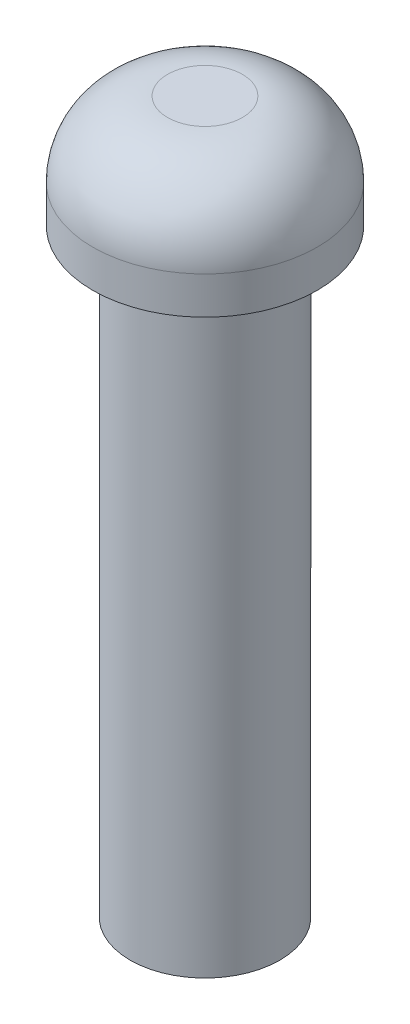
ISO-10303-21;
HEADER;
FILE_DESCRIPTION(('STEP AP214'),'2;1');
FILE_NAME('part.step','',(''),(''),'','','');
FILE_SCHEMA(('AUTOMOTIVE_DESIGN { 1 0 10303 214 1 1 1 1 }'));
ENDSEC;
DATA;
#1=APPLICATION_CONTEXT('core data for automotive mechanical design processes');
#2=APPLICATION_PROTOCOL_DEFINITION('international standard','automotive_design',2000,#1);
#3=PRODUCT_CONTEXT('',#1,'mechanical');
#4=PRODUCT('Part','Part','',(#3));
#5=PRODUCT_RELATED_PRODUCT_CATEGORY('part','',(#4));
#6=PRODUCT_DEFINITION_FORMATION('','',#4);
#7=PRODUCT_DEFINITION_CONTEXT('part definition',#1,'design');
#8=PRODUCT_DEFINITION('design','',#6,#7);
#9=PRODUCT_DEFINITION_SHAPE('','',#8);
#10=(LENGTH_UNIT() NAMED_UNIT(*) SI_UNIT(.MILLI.,.METRE.));
#11=(NAMED_UNIT(*) PLANE_ANGLE_UNIT() SI_UNIT($,.RADIAN.));
#12=(NAMED_UNIT(*) SI_UNIT($,.STERADIAN.) SOLID_ANGLE_UNIT());
#13=UNCERTAINTY_MEASURE_WITH_UNIT(LENGTH_MEASURE(1.E-05),#10,'distance_accuracy_value','');
#14=(GEOMETRIC_REPRESENTATION_CONTEXT(3) GLOBAL_UNCERTAINTY_ASSIGNED_CONTEXT((#13)) GLOBAL_UNIT_ASSIGNED_CONTEXT((#10,
#11,#12)) REPRESENTATION_CONTEXT('',''));
#15=CARTESIAN_POINT('',(0.,0.,0.));
#16=DIRECTION('',(0.,0.,1.));
#17=DIRECTION('',(1.,0.,0.));
#18=AXIS2_PLACEMENT_3D('',#15,#16,#17);
#19=CARTESIAN_POINT('',(0.,0.,0.));
#20=DIRECTION('',(0.,1.,0.));
#21=DIRECTION('',(0.,0.,1.));
#22=AXIS2_PLACEMENT_3D('',#19,#20,#21);
#23=PLANE('',#22);
#24=CARTESIAN_POINT('',(0.,0.,0.));
#25=DIRECTION('',(0.,1.,0.));
#26=DIRECTION('',(0.,0.,1.));
#27=AXIS2_PLACEMENT_3D('',#24,#25,#26);
#28=CIRCLE('',#27,15.);
#29=CARTESIAN_POINT('',(0.,0.,15.));
#30=VERTEX_POINT('',#29);
#31=EDGE_CURVE('E46',#30,#30,#28,.T.);
#32=ORIENTED_EDGE('',*,*,#31,.F.);
#33=EDGE_LOOP('',(#32));
#34=FACE_BOUND('',#33,.T.);
#35=CARTESIAN_POINT('',(0.,0.,0.));
#36=DIRECTION('',(0.,1.,0.));
#37=DIRECTION('',(0.,0.,1.));
#38=AXIS2_PLACEMENT_3D('',#35,#36,#37);
#39=CIRCLE('',#38,10.);
#40=CARTESIAN_POINT('',(0.,0.,10.));
#41=VERTEX_POINT('',#40);
#42=EDGE_CURVE('E10',#41,#41,#39,.F.);
#43=ORIENTED_EDGE('',*,*,#42,.F.);
#44=EDGE_LOOP('',(#43));
#45=FACE_BOUND('',#44,.T.);
#46=ADVANCED_FACE('F31',(#34,#45),#23,.F.);
#47=CARTESIAN_POINT('',(0.,15.,0.));
#48=DIRECTION('',(0.,-1.,0.));
#49=DIRECTION('',(0.,0.,-1.));
#50=AXIS2_PLACEMENT_3D('',#47,#48,#49);
#51=CYLINDRICAL_SURFACE('',#50,15.);
#52=CARTESIAN_POINT('',(0.,5.,0.));
#53=DIRECTION('',(0.,1.,0.));
#54=DIRECTION('',(0.,0.,1.));
#55=AXIS2_PLACEMENT_3D('',#52,#53,#54);
#56=CIRCLE('',#55,15.);
#57=CARTESIAN_POINT('',(0.,5.,15.));
#58=VERTEX_POINT('',#57);
#59=EDGE_CURVE('E38',#58,#58,#56,.F.);
#60=ORIENTED_EDGE('',*,*,#59,.T.);
#61=EDGE_LOOP('',(#60));
#62=FACE_BOUND('',#61,.T.);
#63=ORIENTED_EDGE('',*,*,#31,.T.);
#64=EDGE_LOOP('',(#63));
#65=FACE_BOUND('',#64,.T.);
#66=ADVANCED_FACE('F70',(#62,#65),#51,.T.);
#67=CARTESIAN_POINT('',(0.,15.,0.));
#68=DIRECTION('',(0.,1.,0.));
#69=DIRECTION('',(0.,0.,1.));
#70=AXIS2_PLACEMENT_3D('',#67,#68,#69);
#71=PLANE('',#70);
#72=CARTESIAN_POINT('',(0.,15.,0.));
#73=DIRECTION('',(0.,1.,0.));
#74=DIRECTION('',(0.,0.,1.));
#75=AXIS2_PLACEMENT_3D('',#72,#73,#74);
#76=CIRCLE('',#75,5.);
#77=CARTESIAN_POINT('',(0.,15.,5.));
#78=VERTEX_POINT('',#77);
#79=EDGE_CURVE('E42',#78,#78,#76,.T.);
#80=ORIENTED_EDGE('',*,*,#79,.T.);
#81=EDGE_LOOP('',(#80));
#82=FACE_BOUND('',#81,.T.);
#83=ADVANCED_FACE('F66',(#82),#71,.T.);
#84=CARTESIAN_POINT('',(0.,5.,0.));
#85=DIRECTION('',(0.,1.,0.));
#86=DIRECTION('',(0.,0.,1.));
#87=AXIS2_PLACEMENT_3D('',#84,#85,#86);
#88=DEGENERATE_TOROIDAL_SURFACE('',#87,5.,10.,.T.);
#89=ORIENTED_EDGE('',*,*,#59,.F.);
#90=EDGE_LOOP('',(#89));
#91=FACE_BOUND('',#90,.T.);
#92=ORIENTED_EDGE('',*,*,#79,.F.);
#93=EDGE_LOOP('',(#92));
#94=FACE_BOUND('',#93,.T.);
#95=ADVANCED_FACE('F33',(#91,#94),#88,.T.);
#96=CARTESIAN_POINT('',(0.,-80.,0.));
#97=DIRECTION('',(0.,1.,0.));
#98=DIRECTION('',(0.,0.,1.));
#99=AXIS2_PLACEMENT_3D('',#96,#97,#98);
#100=CYLINDRICAL_SURFACE('',#99,10.);
#101=CARTESIAN_POINT('',(0.,-80.,0.));
#102=DIRECTION('',(0.,-1.,0.));
#103=DIRECTION('',(0.,0.,-1.));
#104=AXIS2_PLACEMENT_3D('',#101,#102,#103);
#105=CIRCLE('',#104,10.);
#106=CARTESIAN_POINT('',(0.,-80.,-10.));
#107=VERTEX_POINT('',#106);
#108=EDGE_CURVE('E51',#107,#107,#105,.T.);
#109=ORIENTED_EDGE('',*,*,#108,.F.);
#110=EDGE_LOOP('',(#109));
#111=FACE_BOUND('',#110,.T.);
#112=ORIENTED_EDGE('',*,*,#42,.T.);
#113=EDGE_LOOP('',(#112));
#114=FACE_BOUND('',#113,.T.);
#115=ADVANCED_FACE('F57',(#111,#114),#100,.T.);
#116=CARTESIAN_POINT('',(0.,-80.,0.));
#117=DIRECTION('',(0.,-1.,0.));
#118=DIRECTION('',(0.,0.,-1.));
#119=AXIS2_PLACEMENT_3D('',#116,#117,#118);
#120=PLANE('',#119);
#121=ORIENTED_EDGE('',*,*,#108,.T.);
#122=EDGE_LOOP('',(#121));
#123=FACE_BOUND('',#122,.T.);
#124=ADVANCED_FACE('F55',(#123),#120,.T.);
#125=CLOSED_SHELL('',(#46,#66,#83,#95,#115,#124));
#126=MANIFOLD_SOLID_BREP('B2',#125);
#127=ADVANCED_BREP_SHAPE_REPRESENTATION('',(#18,#126),#14);
#128=SHAPE_DEFINITION_REPRESENTATION(#9,#127);
ENDSEC;
END-ISO-10303-21;
